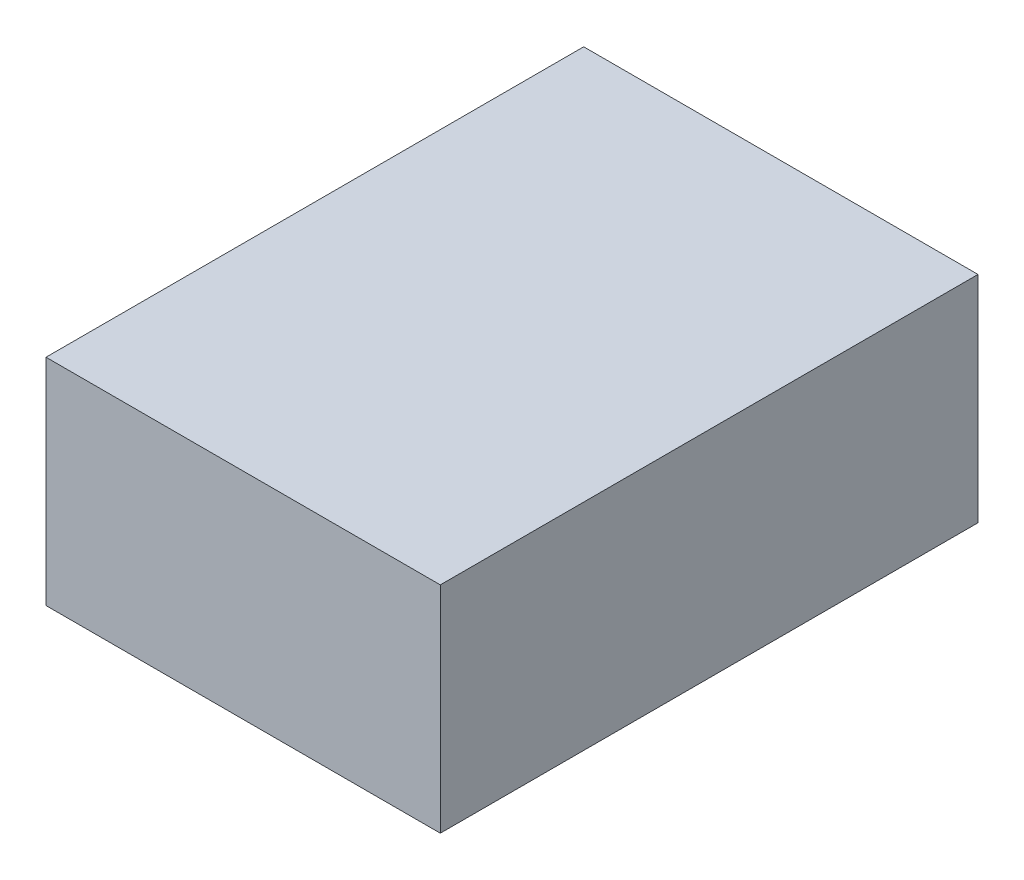
ISO-10303-21;
HEADER;
FILE_DESCRIPTION(('STEP AP214'),'2;1');
FILE_NAME('part.step','',(''),(''),'','','');
FILE_SCHEMA(('AUTOMOTIVE_DESIGN { 1 0 10303 214 1 1 1 1 }'));
ENDSEC;
DATA;
#1=APPLICATION_CONTEXT('core data for automotive mechanical design processes');
#2=APPLICATION_PROTOCOL_DEFINITION('international standard','automotive_design',2000,#1);
#3=PRODUCT_CONTEXT('',#1,'mechanical');
#4=PRODUCT('Part','Part','',(#3));
#5=PRODUCT_RELATED_PRODUCT_CATEGORY('part','',(#4));
#6=PRODUCT_DEFINITION_FORMATION('','',#4);
#7=PRODUCT_DEFINITION_CONTEXT('part definition',#1,'design');
#8=PRODUCT_DEFINITION('design','',#6,#7);
#9=PRODUCT_DEFINITION_SHAPE('','',#8);
#10=(LENGTH_UNIT() NAMED_UNIT(*) SI_UNIT(.MILLI.,.METRE.));
#11=(NAMED_UNIT(*) PLANE_ANGLE_UNIT() SI_UNIT($,.RADIAN.));
#12=(NAMED_UNIT(*) SI_UNIT($,.STERADIAN.) SOLID_ANGLE_UNIT());
#13=UNCERTAINTY_MEASURE_WITH_UNIT(LENGTH_MEASURE(1.E-05),#10,'distance_accuracy_value','');
#14=(GEOMETRIC_REPRESENTATION_CONTEXT(3) GLOBAL_UNCERTAINTY_ASSIGNED_CONTEXT((#13)) GLOBAL_UNIT_ASSIGNED_CONTEXT((#10,
#11,#12)) REPRESENTATION_CONTEXT('',''));
#15=CARTESIAN_POINT('',(0.,0.,0.));
#16=DIRECTION('',(0.,0.,1.));
#17=DIRECTION('',(1.,0.,0.));
#18=AXIS2_PLACEMENT_3D('',#15,#16,#17);
#19=CARTESIAN_POINT('',(0.,0.,300.));
#20=DIRECTION('',(1.,0.,0.));
#21=DIRECTION('',(0.,1.,0.));
#22=AXIS2_PLACEMENT_3D('',#19,#20,#21);
#23=PLANE('',#22);
#24=DIRECTION('',(0.,-1.,0.));
#25=VECTOR('',#24,1.);
#26=CARTESIAN_POINT('',(0.,0.,0.));
#27=LINE('',#26,#25);
#28=CARTESIAN_POINT('',(0.,0.,0.));
#29=VERTEX_POINT('',#28);
#30=CARTESIAN_POINT('',(0.,-120.,0.));
#31=VERTEX_POINT('',#30);
#32=EDGE_CURVE('E96',#29,#31,#27,.T.);
#33=ORIENTED_EDGE('',*,*,#32,.T.);
#34=DIRECTION('',(0.,0.,-1.));
#35=VECTOR('',#34,1.);
#36=CARTESIAN_POINT('',(0.,-120.,300.));
#37=LINE('',#36,#35);
#38=CARTESIAN_POINT('',(0.,-120.,300.));
#39=VERTEX_POINT('',#38);
#40=EDGE_CURVE('E11',#39,#31,#37,.T.);
#41=ORIENTED_EDGE('',*,*,#40,.F.);
#42=DIRECTION('',(0.,-1.,0.));
#43=VECTOR('',#42,1.);
#44=CARTESIAN_POINT('',(0.,0.,300.));
#45=LINE('',#44,#43);
#46=CARTESIAN_POINT('',(0.,0.,300.));
#47=VERTEX_POINT('',#46);
#48=EDGE_CURVE('E84',#47,#39,#45,.T.);
#49=ORIENTED_EDGE('',*,*,#48,.F.);
#50=DIRECTION('',(0.,0.,-1.));
#51=VECTOR('',#50,1.);
#52=CARTESIAN_POINT('',(0.,0.,300.));
#53=LINE('',#52,#51);
#54=EDGE_CURVE('E92',#47,#29,#53,.T.);
#55=ORIENTED_EDGE('',*,*,#54,.T.);
#56=EDGE_LOOP('',(#33,#41,#49,#55));
#57=FACE_BOUND('',#56,.T.);
#58=ADVANCED_FACE('F33',(#57),#23,.F.);
#59=CARTESIAN_POINT('',(0.,-120.,300.));
#60=DIRECTION('',(0.,1.,0.));
#61=DIRECTION('',(0.,0.,1.));
#62=AXIS2_PLACEMENT_3D('',#59,#60,#61);
#63=PLANE('',#62);
#64=DIRECTION('',(1.,0.,0.));
#65=VECTOR('',#64,1.);
#66=CARTESIAN_POINT('',(0.,-120.,0.));
#67=LINE('',#66,#65);
#68=CARTESIAN_POINT('',(220.,-120.,0.));
#69=VERTEX_POINT('',#68);
#70=EDGE_CURVE('E88',#31,#69,#67,.T.);
#71=ORIENTED_EDGE('',*,*,#70,.T.);
#72=DIRECTION('',(0.,0.,-1.));
#73=VECTOR('',#72,1.);
#74=CARTESIAN_POINT('',(220.,-120.,300.));
#75=LINE('',#74,#73);
#76=CARTESIAN_POINT('',(220.,-120.,300.));
#77=VERTEX_POINT('',#76);
#78=EDGE_CURVE('E41',#77,#69,#75,.T.);
#79=ORIENTED_EDGE('',*,*,#78,.F.);
#80=DIRECTION('',(1.,0.,0.));
#81=VECTOR('',#80,1.);
#82=CARTESIAN_POINT('',(0.,-120.,300.));
#83=LINE('',#82,#81);
#84=EDGE_CURVE('E79',#39,#77,#83,.T.);
#85=ORIENTED_EDGE('',*,*,#84,.F.);
#86=ORIENTED_EDGE('',*,*,#40,.T.);
#87=EDGE_LOOP('',(#71,#79,#85,#86));
#88=FACE_BOUND('',#87,.T.);
#89=ADVANCED_FACE('F87',(#88),#63,.F.);
#90=CARTESIAN_POINT('',(220.,0.,300.));
#91=DIRECTION('',(-1.,0.,0.));
#92=DIRECTION('',(0.,-1.,0.));
#93=AXIS2_PLACEMENT_3D('',#90,#91,#92);
#94=PLANE('',#93);
#95=DIRECTION('',(0.,1.,0.));
#96=VECTOR('',#95,1.);
#97=CARTESIAN_POINT('',(220.,0.,0.));
#98=LINE('',#97,#96);
#99=CARTESIAN_POINT('',(220.,0.,0.));
#100=VERTEX_POINT('',#99);
#101=EDGE_CURVE('E66',#69,#100,#98,.T.);
#102=ORIENTED_EDGE('',*,*,#101,.T.);
#103=DIRECTION('',(0.,0.,-1.));
#104=VECTOR('',#103,1.);
#105=CARTESIAN_POINT('',(220.,0.,300.));
#106=LINE('',#105,#104);
#107=CARTESIAN_POINT('',(220.,0.,300.));
#108=VERTEX_POINT('',#107);
#109=EDGE_CURVE('E89',#108,#100,#106,.T.);
#110=ORIENTED_EDGE('',*,*,#109,.F.);
#111=DIRECTION('',(0.,1.,0.));
#112=VECTOR('',#111,1.);
#113=CARTESIAN_POINT('',(220.,0.,300.));
#114=LINE('',#113,#112);
#115=EDGE_CURVE('E82',#77,#108,#114,.T.);
#116=ORIENTED_EDGE('',*,*,#115,.F.);
#117=ORIENTED_EDGE('',*,*,#78,.T.);
#118=EDGE_LOOP('',(#102,#110,#116,#117));
#119=FACE_BOUND('',#118,.T.);
#120=ADVANCED_FACE('F90',(#119),#94,.F.);
#121=CARTESIAN_POINT('',(0.,0.,300.));
#122=DIRECTION('',(0.,-1.,0.));
#123=DIRECTION('',(0.,0.,-1.));
#124=AXIS2_PLACEMENT_3D('',#121,#122,#123);
#125=PLANE('',#124);
#126=DIRECTION('',(-1.,0.,0.));
#127=VECTOR('',#126,1.);
#128=CARTESIAN_POINT('',(0.,0.,0.));
#129=LINE('',#128,#127);
#130=EDGE_CURVE('E72',#100,#29,#129,.T.);
#131=ORIENTED_EDGE('',*,*,#130,.T.);
#132=ORIENTED_EDGE('',*,*,#54,.F.);
#133=DIRECTION('',(-1.,0.,0.));
#134=VECTOR('',#133,1.);
#135=CARTESIAN_POINT('',(0.,0.,300.));
#136=LINE('',#135,#134);
#137=EDGE_CURVE('E49',#108,#47,#136,.T.);
#138=ORIENTED_EDGE('',*,*,#137,.F.);
#139=ORIENTED_EDGE('',*,*,#109,.T.);
#140=EDGE_LOOP('',(#131,#132,#138,#139));
#141=FACE_BOUND('',#140,.T.);
#142=ADVANCED_FACE('F103',(#141),#125,.F.);
#143=CARTESIAN_POINT('',(0.,0.,300.));
#144=DIRECTION('',(0.,0.,1.));
#145=DIRECTION('',(1.,0.,0.));
#146=AXIS2_PLACEMENT_3D('',#143,#144,#145);
#147=PLANE('',#146);
#148=ORIENTED_EDGE('',*,*,#48,.T.);
#149=ORIENTED_EDGE('',*,*,#84,.T.);
#150=ORIENTED_EDGE('',*,*,#115,.T.);
#151=ORIENTED_EDGE('',*,*,#137,.T.);
#152=EDGE_LOOP('',(#148,#149,#150,#151));
#153=FACE_BOUND('',#152,.T.);
#154=ADVANCED_FACE('F80',(#153),#147,.T.);
#155=CARTESIAN_POINT('',(0.,0.,0.));
#156=DIRECTION('',(0.,0.,1.));
#157=DIRECTION('',(1.,0.,0.));
#158=AXIS2_PLACEMENT_3D('',#155,#156,#157);
#159=PLANE('',#158);
#160=ORIENTED_EDGE('',*,*,#32,.F.);
#161=ORIENTED_EDGE('',*,*,#130,.F.);
#162=ORIENTED_EDGE('',*,*,#101,.F.);
#163=ORIENTED_EDGE('',*,*,#70,.F.);
#164=EDGE_LOOP('',(#160,#161,#162,#163));
#165=FACE_BOUND('',#164,.T.);
#166=ADVANCED_FACE('F106',(#165),#159,.F.);
#167=CLOSED_SHELL('',(#58,#89,#120,#142,#154,#166));
#168=MANIFOLD_SOLID_BREP('B2',#167);
#169=ADVANCED_BREP_SHAPE_REPRESENTATION('',(#18,#168),#14);
#170=SHAPE_DEFINITION_REPRESENTATION(#9,#169);
ENDSEC;
END-ISO-10303-21;
